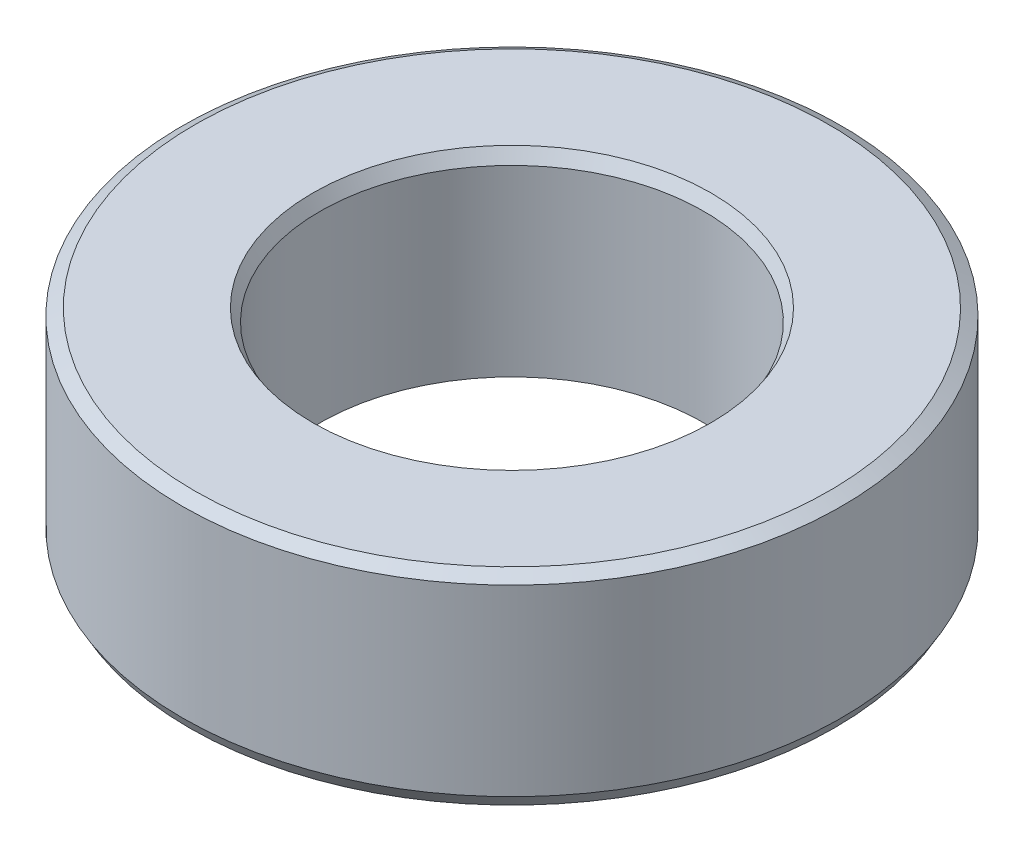
ISO-10303-21;
HEADER;
FILE_DESCRIPTION(('STEP AP214'),'2;1');
FILE_NAME('part.step','',(''),(''),'','','');
FILE_SCHEMA(('AUTOMOTIVE_DESIGN { 1 0 10303 214 1 1 1 1 }'));
ENDSEC;
DATA;
#1=APPLICATION_CONTEXT('core data for automotive mechanical design processes');
#2=APPLICATION_PROTOCOL_DEFINITION('international standard','automotive_design',2000,#1);
#3=PRODUCT_CONTEXT('',#1,'mechanical');
#4=PRODUCT('Part','Part','',(#3));
#5=PRODUCT_RELATED_PRODUCT_CATEGORY('part','',(#4));
#6=PRODUCT_DEFINITION_FORMATION('','',#4);
#7=PRODUCT_DEFINITION_CONTEXT('part definition',#1,'design');
#8=PRODUCT_DEFINITION('design','',#6,#7);
#9=PRODUCT_DEFINITION_SHAPE('','',#8);
#10=(LENGTH_UNIT() NAMED_UNIT(*) SI_UNIT(.MILLI.,.METRE.));
#11=(NAMED_UNIT(*) PLANE_ANGLE_UNIT() SI_UNIT($,.RADIAN.));
#12=(NAMED_UNIT(*) SI_UNIT($,.STERADIAN.) SOLID_ANGLE_UNIT());
#13=UNCERTAINTY_MEASURE_WITH_UNIT(LENGTH_MEASURE(1.E-05),#10,'distance_accuracy_value','');
#14=(GEOMETRIC_REPRESENTATION_CONTEXT(3) GLOBAL_UNCERTAINTY_ASSIGNED_CONTEXT((#13)) GLOBAL_UNIT_ASSIGNED_CONTEXT((#10,
#11,#12)) REPRESENTATION_CONTEXT('',''));
#15=CARTESIAN_POINT('',(0.,0.,0.));
#16=DIRECTION('',(0.,0.,1.));
#17=DIRECTION('',(1.,0.,0.));
#18=AXIS2_PLACEMENT_3D('',#15,#16,#17);
#19=CARTESIAN_POINT('',(0.,30.7495279467967,0.));
#20=DIRECTION('',(0.,-1.,0.));
#21=DIRECTION('',(0.,0.,-1.));
#22=AXIS2_PLACEMENT_3D('',#19,#20,#21);
#23=CYLINDRICAL_SURFACE('',#22,50.);
#24=CARTESIAN_POINT('',(0.,1.87397294825911,0.));
#25=DIRECTION('',(0.,1.,0.));
#26=DIRECTION('',(0.,0.,1.));
#27=AXIS2_PLACEMENT_3D('',#24,#25,#26);
#28=CIRCLE('',#27,50.);
#29=CARTESIAN_POINT('',(0.,1.87397294825911,50.));
#30=VERTEX_POINT('',#29);
#31=EDGE_CURVE('E10',#30,#30,#28,.T.);
#32=ORIENTED_EDGE('',*,*,#31,.T.);
#33=EDGE_LOOP('',(#32));
#34=FACE_BOUND('',#33,.T.);
#35=CARTESIAN_POINT('',(0.,29.6675891606652,0.));
#36=DIRECTION('',(0.,1.,0.));
#37=DIRECTION('',(0.,0.,1.));
#38=AXIS2_PLACEMENT_3D('',#35,#36,#37);
#39=CIRCLE('',#38,50.);
#40=CARTESIAN_POINT('',(0.,29.6675891606652,50.));
#41=VERTEX_POINT('',#40);
#42=EDGE_CURVE('E50',#41,#41,#39,.F.);
#43=ORIENTED_EDGE('',*,*,#42,.T.);
#44=EDGE_LOOP('',(#43));
#45=FACE_BOUND('',#44,.T.);
#46=ADVANCED_FACE('F39',(#34,#45),#23,.T.);
#47=CARTESIAN_POINT('',(0.,30.7495279467967,0.));
#48=DIRECTION('',(0.,1.,0.));
#49=DIRECTION('',(0.,0.,1.));
#50=AXIS2_PLACEMENT_3D('',#47,#48,#49);
#51=PLANE('',#50);
#52=CARTESIAN_POINT('',(0.,30.7495279467967,0.));
#53=DIRECTION('',(0.,1.,0.));
#54=DIRECTION('',(0.,0.,1.));
#55=AXIS2_PLACEMENT_3D('',#52,#53,#54);
#56=CIRCLE('',#55,30.2064096366827);
#57=CARTESIAN_POINT('',(0.,30.7495279467967,30.2064096366827));
#58=VERTEX_POINT('',#57);
#59=EDGE_CURVE('E58',#58,#58,#56,.F.);
#60=ORIENTED_EDGE('',*,*,#59,.T.);
#61=EDGE_LOOP('',(#60));
#62=FACE_BOUND('',#61,.T.);
#63=CARTESIAN_POINT('',(0.,30.7495279467967,0.));
#64=DIRECTION('',(0.,1.,0.));
#65=DIRECTION('',(0.,0.,1.));
#66=AXIS2_PLACEMENT_3D('',#63,#64,#65);
#67=CIRCLE('',#66,48.1260270517408);
#68=CARTESIAN_POINT('',(0.,30.7495279467967,48.1260270517408));
#69=VERTEX_POINT('',#68);
#70=EDGE_CURVE('E61',#69,#69,#67,.T.);
#71=ORIENTED_EDGE('',*,*,#70,.T.);
#72=EDGE_LOOP('',(#71));
#73=FACE_BOUND('',#72,.T.);
#74=ADVANCED_FACE('F88',(#62,#73),#51,.T.);
#75=CARTESIAN_POINT('',(0.,0.,0.));
#76=DIRECTION('',(0.,1.,0.));
#77=DIRECTION('',(0.,0.,1.));
#78=AXIS2_PLACEMENT_3D('',#75,#76,#77);
#79=PLANE('',#78);
#80=CARTESIAN_POINT('',(0.,0.,0.));
#81=DIRECTION('',(0.,1.,0.));
#82=DIRECTION('',(0.,0.,1.));
#83=AXIS2_PLACEMENT_3D('',#80,#81,#82);
#84=CIRCLE('',#83,30.9984437988104);
#85=CARTESIAN_POINT('',(0.,0.,30.9984437988104));
#86=VERTEX_POINT('',#85);
#87=EDGE_CURVE('E51',#86,#86,#84,.T.);
#88=ORIENTED_EDGE('',*,*,#87,.T.);
#89=EDGE_LOOP('',(#88));
#90=FACE_BOUND('',#89,.T.);
#91=CARTESIAN_POINT('',(0.,0.,0.));
#92=DIRECTION('',(0.,1.,0.));
#93=DIRECTION('',(0.,0.,1.));
#94=AXIS2_PLACEMENT_3D('',#91,#92,#93);
#95=CIRCLE('',#94,48.9180612138685);
#96=CARTESIAN_POINT('',(0.,0.,48.9180612138685));
#97=VERTEX_POINT('',#96);
#98=EDGE_CURVE('E54',#97,#97,#95,.F.);
#99=ORIENTED_EDGE('',*,*,#98,.T.);
#100=EDGE_LOOP('',(#99));
#101=FACE_BOUND('',#100,.T.);
#102=ADVANCED_FACE('F83',(#90,#101),#79,.F.);
#103=CARTESIAN_POINT('',(0.,30.7495279467967,0.));
#104=DIRECTION('',(0.,-1.,0.));
#105=DIRECTION('',(0.,0.,-1.));
#106=AXIS2_PLACEMENT_3D('',#103,#104,#105);
#107=CYLINDRICAL_SURFACE('',#106,29.1244708505513);
#108=CARTESIAN_POINT('',(0.,28.8755549985376,0.));
#109=DIRECTION('',(0.,1.,0.));
#110=DIRECTION('',(0.,0.,1.));
#111=AXIS2_PLACEMENT_3D('',#108,#109,#110);
#112=CIRCLE('',#111,29.1244708505513);
#113=CARTESIAN_POINT('',(0.,28.8755549985376,29.1244708505513));
#114=VERTEX_POINT('',#113);
#115=EDGE_CURVE('E67',#114,#114,#112,.T.);
#116=ORIENTED_EDGE('',*,*,#115,.T.);
#117=EDGE_LOOP('',(#116));
#118=FACE_BOUND('',#117,.T.);
#119=CARTESIAN_POINT('',(0.,1.0819387861315,0.));
#120=DIRECTION('',(0.,1.,0.));
#121=DIRECTION('',(0.,0.,1.));
#122=AXIS2_PLACEMENT_3D('',#119,#120,#121);
#123=CIRCLE('',#122,29.1244708505513);
#124=CARTESIAN_POINT('',(0.,1.0819387861315,29.1244708505513));
#125=VERTEX_POINT('',#124);
#126=EDGE_CURVE('E69',#125,#125,#123,.F.);
#127=ORIENTED_EDGE('',*,*,#126,.T.);
#128=EDGE_LOOP('',(#127));
#129=FACE_BOUND('',#128,.T.);
#130=ADVANCED_FACE('F71',(#118,#129),#107,.F.);
#131=CARTESIAN_POINT('',(0.,28.8755549985376,0.));
#132=DIRECTION('',(0.,1.,0.));
#133=DIRECTION('',(0.,0.,1.));
#134=AXIS2_PLACEMENT_3D('',#131,#132,#133);
#135=CONICAL_SURFACE('',#134,29.1244708505513,0.523598775598309);
#136=CARTESIAN_POINT('',(0.,30.7495279467967,30.2064096366827));
#137=CARTESIAN_POINT('',(0.,30.7300073952524,30.1951394409939));
#138=CARTESIAN_POINT('',(0.,30.710486843708,30.183869245305));
#139=CARTESIAN_POINT('',(0.,30.6714457406193,30.1613288539273));
#140=CARTESIAN_POINT('',(0.,30.6519251890749,30.1500586582384));
#141=CARTESIAN_POINT('',(0.,30.6128840859862,30.1275182668607));
#142=CARTESIAN_POINT('',(0.,30.5933635344418,30.1162480711718));
#143=CARTESIAN_POINT('',(0.,30.5543224313531,30.0937076797941));
#144=CARTESIAN_POINT('',(0.,30.5348018798087,30.0824374841052));
#145=CARTESIAN_POINT('',(0.,30.49576077672,30.0598970927274));
#146=CARTESIAN_POINT('',(0.,30.4762402251756,30.0486268970386));
#147=CARTESIAN_POINT('',(0.,30.4371991220869,30.0260865056608));
#148=CARTESIAN_POINT('',(0.,30.4176785705425,30.014816309972));
#149=CARTESIAN_POINT('',(0.,30.3786374674538,29.9922759185942));
#150=CARTESIAN_POINT('',(0.,30.3591169159094,29.9810057229054));
#151=CARTESIAN_POINT('',(0.,30.3200758128207,29.9584653315276));
#152=CARTESIAN_POINT('',(0.,30.3005552612763,29.9471951358387));
#153=CARTESIAN_POINT('',(0.,30.2615141581876,29.924654744461));
#154=CARTESIAN_POINT('',(0.,30.2419936066432,29.9133845487721));
#155=CARTESIAN_POINT('',(0.,30.2029525035545,29.8908441573944));
#156=CARTESIAN_POINT('',(0.,30.1834319520101,29.8795739617055));
#157=CARTESIAN_POINT('',(0.,30.1443908489214,29.8570335703278));
#158=CARTESIAN_POINT('',(0.,30.124870297377,29.8457633746389));
#159=CARTESIAN_POINT('',(0.,30.0858291942883,29.8232229832612));
#160=CARTESIAN_POINT('',(0.,30.0663086427439,29.8119527875723));
#161=CARTESIAN_POINT('',(0.,30.0272675396552,29.7894123961946));
#162=CARTESIAN_POINT('',(0.,30.0077469881108,29.7781422005057));
#163=CARTESIAN_POINT('',(0.,29.9687058850221,29.755601809128));
#164=CARTESIAN_POINT('',(0.,29.9491853334777,29.7443316134391));
#165=CARTESIAN_POINT('',(0.,29.910144230389,29.7217912220613));
#166=CARTESIAN_POINT('',(0.,29.8906236788446,29.7105210263725));
#167=CARTESIAN_POINT('',(0.,29.8515825757559,29.6879806349947));
#168=CARTESIAN_POINT('',(0.,29.8320620242115,29.6767104393059));
#169=CARTESIAN_POINT('',(0.,29.7930209211228,29.6541700479281));
#170=CARTESIAN_POINT('',(0.,29.7735003695784,29.6428998522393));
#171=CARTESIAN_POINT('',(0.,29.7344592664897,29.6203594608615));
#172=CARTESIAN_POINT('',(0.,29.7149387149453,29.6090892651726));
#173=CARTESIAN_POINT('',(0.,29.6758976118566,29.5865488737949));
#174=CARTESIAN_POINT('',(0.,29.6563770603122,29.575278678106));
#175=CARTESIAN_POINT('',(0.,29.6173359572235,29.5527382867283));
#176=CARTESIAN_POINT('',(0.,29.5978154056792,29.5414680910394));
#177=CARTESIAN_POINT('',(0.,29.5587743025904,29.5189276996617));
#178=CARTESIAN_POINT('',(0.,29.5392537510461,29.5076575039728));
#179=CARTESIAN_POINT('',(0.,29.5002126479573,29.4851171125951));
#180=CARTESIAN_POINT('',(0.,29.480692096413,29.4738469169062));
#181=CARTESIAN_POINT('',(0.,29.4416509933242,29.4513065255285));
#182=CARTESIAN_POINT('',(0.,29.4221304417799,29.4400363298396));
#183=CARTESIAN_POINT('',(0.,29.3830893386911,29.4174959384619));
#184=CARTESIAN_POINT('',(0.,29.3635687871468,29.406225742773));
#185=CARTESIAN_POINT('',(0.,29.324527684058,29.3836853513953));
#186=CARTESIAN_POINT('',(0.,29.3050071325137,29.3724151557064));
#187=CARTESIAN_POINT('',(0.,29.2659660294249,29.3498747643286));
#188=CARTESIAN_POINT('',(0.,29.2464454778806,29.3386045686398));
#189=CARTESIAN_POINT('',(0.,29.2074043747918,29.316064177262));
#190=CARTESIAN_POINT('',(0.,29.1878838232475,29.3047939815732));
#191=CARTESIAN_POINT('',(0.,29.1488427201587,29.2822535901954));
#192=CARTESIAN_POINT('',(0.,29.1293221686144,29.2709833945066));
#193=CARTESIAN_POINT('',(0.,29.0902810655256,29.2484430031288));
#194=CARTESIAN_POINT('',(0.,29.0707605139813,29.2371728074399));
#195=CARTESIAN_POINT('',(0.,29.0317194108925,29.2146324160622));
#196=CARTESIAN_POINT('',(0.,29.0121988593482,29.2033622203733));
#197=CARTESIAN_POINT('',(0.,28.9731577562595,29.1808218289956));
#198=CARTESIAN_POINT('',(0.,28.9536372047151,29.1695516333067));
#199=CARTESIAN_POINT('',(0.,28.9145961016264,29.147011241929));
#200=CARTESIAN_POINT('',(0.,28.895075550082,29.1357410462401));
#201=CARTESIAN_POINT('',(0.,28.8755549985376,29.1244708505513));
#202=B_SPLINE_CURVE_WITH_KNOTS('',3,(#136,#137,#138,#139,#140,#141,#142,#143,#144,#145,#146,
#147,#148,#149,#150,#151,#152,#153,#154,#155,#156,#157,#158,#159,#160,#161,#162,#163,#164,#165,
#166,#167,#168,#169,#170,#171,#172,#173,#174,#175,#176,#177,#178,#179,#180,#181,#182,#183,#184,
#185,#186,#187,#188,#189,#190,#191,#192,#193,#194,#195,#196,#197,#198,#199,#200,#201),
.UNSPECIFIED.,.F.,.F.,(4,2,2,2,2,2,2,2,2,2,2,2,2,2,2,2,2,2,2,2,2,2,2,2,2,2,2,2,2,2,2,2,4),(0.,
0.0676211741332198,0.135242348266437,0.202863522399653,0.27048469653287,0.33810587066609,
0.405727044799307,0.473348218932523,0.54096939306574,0.60859056719896,0.676211741332177,
0.743832915465395,0.811454089598612,0.879075263731832,0.946696437865049,1.01431761199827,
1.08193878613148,1.1495599602647,1.21718113439792,1.28480230853114,1.35242348266435,
1.42004465679757,1.48766583093079,1.55528700506401,1.62290817919723,1.69052935333044,
1.75815052746366,1.82577170159688,1.8933928757301,1.96101404986331,2.02863522399653,
2.09625639812975,2.16387757226296),.UNSPECIFIED.);
#203=EDGE_CURVE('BSEAM77',#58,#114,#202,.T.);
#204=ORIENTED_EDGE('',*,*,#59,.F.);
#205=ORIENTED_EDGE('',*,*,#115,.F.);
#206=ORIENTED_EDGE('',*,*,#203,.T.);
#207=ORIENTED_EDGE('',*,*,#203,.F.);
#208=EDGE_LOOP('',(#204,#206,#205,#207));
#209=FACE_BOUND('',#208,.T.);
#210=ADVANCED_FACE('F77',(#209),#135,.F.);
#211=CARTESIAN_POINT('',(0.,0.,0.));
#212=DIRECTION('',(0.,-1.,0.));
#213=DIRECTION('',(0.,0.,-1.));
#214=AXIS2_PLACEMENT_3D('',#211,#212,#213);
#215=CONICAL_SURFACE('',#214,30.9984437988104,1.04719755119659);
#216=ORIENTED_EDGE('',*,*,#126,.F.);
#217=EDGE_LOOP('',(#216));
#218=FACE_BOUND('',#217,.T.);
#219=ORIENTED_EDGE('',*,*,#87,.F.);
#220=EDGE_LOOP('',(#219));
#221=FACE_BOUND('',#220,.T.);
#222=ADVANCED_FACE('F73',(#218,#221),#215,.F.);
#223=CARTESIAN_POINT('',(0.,1.87397294825911,0.));
#224=DIRECTION('',(0.,1.,0.));
#225=DIRECTION('',(0.,0.,1.));
#226=AXIS2_PLACEMENT_3D('',#223,#224,#225);
#227=CONICAL_SURFACE('',#226,50.,0.523598775598305);
#228=CARTESIAN_POINT('',(0.,0.,48.9180612138685));
#229=CARTESIAN_POINT('',(0.,0.0195205515443672,48.9293314095574));
#230=CARTESIAN_POINT('',(0.,0.0390411030887324,48.9406016052463));
#231=CARTESIAN_POINT('',(0.,0.0780822061774627,48.963141996624));
#232=CARTESIAN_POINT('',(0.,0.0976027577218278,48.9744121923129));
#233=CARTESIAN_POINT('',(0.,0.13664386081056,48.9969525836906));
#234=CARTESIAN_POINT('',(0.,0.156164412354926,49.0082227793795));
#235=CARTESIAN_POINT('',(0.,0.195205515443658,49.0307631707572));
#236=CARTESIAN_POINT('',(0.,0.214726066988022,49.0420333664461));
#237=CARTESIAN_POINT('',(0.,0.253767170076754,49.0645737578238));
#238=CARTESIAN_POINT('',(0.,0.273287721621121,49.0758439535127));
#239=CARTESIAN_POINT('',(0.,0.312328824709852,49.0983843448904));
#240=CARTESIAN_POINT('',(0.,0.331849376254217,49.1096545405793));
#241=CARTESIAN_POINT('',(0.,0.370890479342948,49.132194931957));
#242=CARTESIAN_POINT('',(0.,0.390411030887315,49.1434651276459));
#243=CARTESIAN_POINT('',(0.,0.429452133976047,49.1660055190236));
#244=CARTESIAN_POINT('',(0.,0.448972685520411,49.1772757147125));
#245=CARTESIAN_POINT('',(0.,0.488013788609143,49.1998161060903));
#246=CARTESIAN_POINT('',(0.,0.50753434015351,49.2110863017791));
#247=CARTESIAN_POINT('',(0.,0.546575443242241,49.2336266931569));
#248=CARTESIAN_POINT('',(0.,0.566095994786606,49.2448968888457));
#249=CARTESIAN_POINT('',(0.,0.605137097875337,49.2674372802235));
#250=CARTESIAN_POINT('',(0.,0.624657649419704,49.2787074759123));
#251=CARTESIAN_POINT('',(0.,0.663698752508436,49.3012478672901));
#252=CARTESIAN_POINT('',(0.,0.6832193040528,49.312518062979));
#253=CARTESIAN_POINT('',(0.,0.722260407141532,49.3350584543567));
#254=CARTESIAN_POINT('',(0.,0.741780958685899,49.3463286500456));
#255=CARTESIAN_POINT('',(0.,0.78082206177463,49.3688690414233));
#256=CARTESIAN_POINT('',(0.,0.800342613318995,49.3801392371122));
#257=CARTESIAN_POINT('',(0.,0.839383716407726,49.4026796284899));
#258=CARTESIAN_POINT('',(0.,0.858904267952092,49.4139498241788));
#259=CARTESIAN_POINT('',(0.,0.897945371040825,49.4364902155565));
#260=CARTESIAN_POINT('',(0.,0.917465922585191,49.4477604112454));
#261=CARTESIAN_POINT('',(0.,0.956507025673922,49.4703008026231));
#262=CARTESIAN_POINT('',(0.,0.976027577218287,49.481570998312));
#263=CARTESIAN_POINT('',(0.,1.01506868030702,49.5041113896897));
#264=CARTESIAN_POINT('',(0.,1.03458923185139,49.5153815853786));
#265=CARTESIAN_POINT('',(0.,1.07363033494012,49.5379219767563));
#266=CARTESIAN_POINT('',(0.,1.09315088648448,49.5491921724452));
#267=CARTESIAN_POINT('',(0.,1.13219198957321,49.571732563823));
#268=CARTESIAN_POINT('',(0.,1.15171254111758,49.5830027595118));
#269=CARTESIAN_POINT('',(0.,1.19075364420631,49.6055431508896));
#270=CARTESIAN_POINT('',(0.,1.21027419575068,49.6168133465784));
#271=CARTESIAN_POINT('',(0.,1.24931529883941,49.6393537379562));
#272=CARTESIAN_POINT('',(0.,1.26883585038377,49.650623933645));
#273=CARTESIAN_POINT('',(0.,1.30787695347251,49.6731643250228));
#274=CARTESIAN_POINT('',(0.,1.32739750501687,49.6844345207117));
#275=CARTESIAN_POINT('',(0.,1.3664386081056,49.7069749120894));
#276=CARTESIAN_POINT('',(0.,1.38595915964997,49.7182451077783));
#277=CARTESIAN_POINT('',(0.,1.4250002627387,49.740785499156));
#278=CARTESIAN_POINT('',(0.,1.44452081428306,49.7520556948449));
#279=CARTESIAN_POINT('',(0.,1.4835619173718,49.7745960862226));
#280=CARTESIAN_POINT('',(0.,1.50308246891616,49.7858662819115));
#281=CARTESIAN_POINT('',(0.,1.54212357200489,49.8084066732892));
#282=CARTESIAN_POINT('',(0.,1.56164412354926,49.8196768689781));
#283=CARTESIAN_POINT('',(0.,1.60068522663799,49.8422172603558));
#284=CARTESIAN_POINT('',(0.,1.62020577818236,49.8534874560447));
#285=CARTESIAN_POINT('',(0.,1.65924688127109,49.8760278474224));
#286=CARTESIAN_POINT('',(0.,1.67876743281545,49.8872980431113));
#287=CARTESIAN_POINT('',(0.,1.71780853590418,49.909838434489));
#288=CARTESIAN_POINT('',(0.,1.73732908744855,49.9211086301779));
#289=CARTESIAN_POINT('',(0.,1.77637019053728,49.9436490215557));
#290=CARTESIAN_POINT('',(0.,1.79589074208165,49.9549192172445));
#291=CARTESIAN_POINT('',(0.,1.83493184517038,49.9774596086223));
#292=CARTESIAN_POINT('',(0.,1.85445239671474,49.9887298043111));
#293=CARTESIAN_POINT('',(0.,1.87397294825911,50.));
#294=B_SPLINE_CURVE_WITH_KNOTS('',3,(#228,#229,#230,#231,#232,#233,#234,#235,#236,#237,#238,
#239,#240,#241,#242,#243,#244,#245,#246,#247,#248,#249,#250,#251,#252,#253,#254,#255,#256,#257,
#258,#259,#260,#261,#262,#263,#264,#265,#266,#267,#268,#269,#270,#271,#272,#273,#274,#275,#276,
#277,#278,#279,#280,#281,#282,#283,#284,#285,#286,#287,#288,#289,#290,#291,#292,#293),
.UNSPECIFIED.,.F.,.F.,(4,2,2,2,2,2,2,2,2,2,2,2,2,2,2,2,2,2,2,2,2,2,2,2,2,2,2,2,2,2,2,2,4),(0.,
0.0676211741332158,0.135242348266435,0.202863522399651,0.27048469653287,0.338105870666086,
0.405727044799305,0.473348218932521,0.54096939306574,0.608590567198956,0.676211741332175,
0.743832915465391,0.81145408959861,0.879075263731826,0.946696437865045,1.01431761199826,
1.08193878613148,1.1495599602647,1.21718113439791,1.28480230853113,1.35242348266435,
1.42004465679757,1.48766583093078,1.555287005064,1.62290817919722,1.69052935333044,
1.75815052746365,1.82577170159687,1.89339287573009,1.96101404986331,2.02863522399652,
2.09625639812974,2.16387757226296),.UNSPECIFIED.);
#295=EDGE_CURVE('BSEAM76',#97,#30,#294,.T.);
#296=ORIENTED_EDGE('',*,*,#98,.F.);
#297=ORIENTED_EDGE('',*,*,#31,.F.);
#298=ORIENTED_EDGE('',*,*,#295,.T.);
#299=ORIENTED_EDGE('',*,*,#295,.F.);
#300=EDGE_LOOP('',(#296,#298,#297,#299));
#301=FACE_BOUND('',#300,.T.);
#302=ADVANCED_FACE('F76',(#301),#227,.T.);
#303=CARTESIAN_POINT('',(0.,30.7495279467967,0.));
#304=DIRECTION('',(0.,-1.,0.));
#305=DIRECTION('',(0.,0.,-1.));
#306=AXIS2_PLACEMENT_3D('',#303,#304,#305);
#307=CONICAL_SURFACE('',#306,48.1260270517408,1.04719755119659);
#308=ORIENTED_EDGE('',*,*,#42,.F.);
#309=EDGE_LOOP('',(#308));
#310=FACE_BOUND('',#309,.T.);
#311=ORIENTED_EDGE('',*,*,#70,.F.);
#312=EDGE_LOOP('',(#311));
#313=FACE_BOUND('',#312,.T.);
#314=ADVANCED_FACE('F45',(#310,#313),#307,.T.);
#315=CLOSED_SHELL('',(#46,#74,#102,#130,#210,#222,#302,#314));
#316=MANIFOLD_SOLID_BREP('B2',#315);
#317=ADVANCED_BREP_SHAPE_REPRESENTATION('',(#18,#316),#14);
#318=SHAPE_DEFINITION_REPRESENTATION(#9,#317);
ENDSEC;
END-ISO-10303-21;
